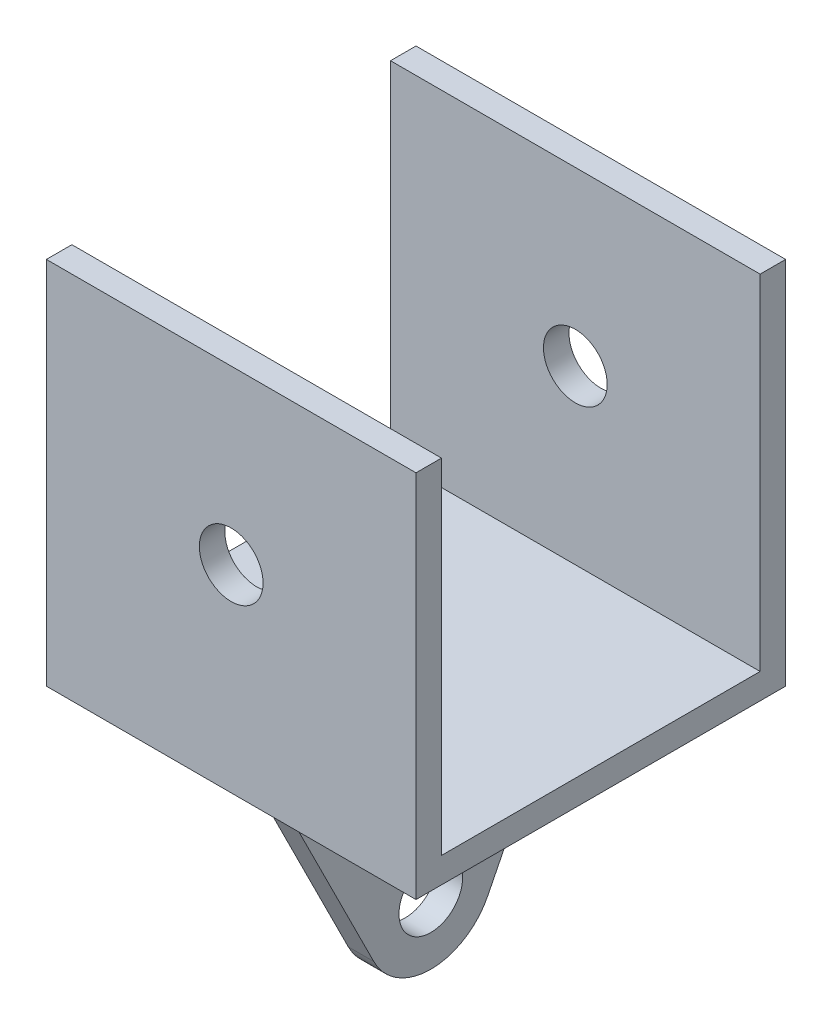
ISO-10303-21;
HEADER;
FILE_DESCRIPTION(('STEP AP214'),'2;1');
FILE_NAME('part.step','',(''),(''),'','','');
FILE_SCHEMA(('AUTOMOTIVE_DESIGN { 1 0 10303 214 1 1 1 1 }'));
ENDSEC;
DATA;
#1=APPLICATION_CONTEXT('core data for automotive mechanical design processes');
#2=APPLICATION_PROTOCOL_DEFINITION('international standard','automotive_design',2000,#1);
#3=PRODUCT_CONTEXT('',#1,'mechanical');
#4=PRODUCT('Part','Part','',(#3));
#5=PRODUCT_RELATED_PRODUCT_CATEGORY('part','',(#4));
#6=PRODUCT_DEFINITION_FORMATION('','',#4);
#7=PRODUCT_DEFINITION_CONTEXT('part definition',#1,'design');
#8=PRODUCT_DEFINITION('design','',#6,#7);
#9=PRODUCT_DEFINITION_SHAPE('','',#8);
#10=(LENGTH_UNIT() NAMED_UNIT(*) SI_UNIT(.MILLI.,.METRE.));
#11=(NAMED_UNIT(*) PLANE_ANGLE_UNIT() SI_UNIT($,.RADIAN.));
#12=(NAMED_UNIT(*) SI_UNIT($,.STERADIAN.) SOLID_ANGLE_UNIT());
#13=UNCERTAINTY_MEASURE_WITH_UNIT(LENGTH_MEASURE(1.E-05),#10,'distance_accuracy_value','');
#14=(GEOMETRIC_REPRESENTATION_CONTEXT(3) GLOBAL_UNCERTAINTY_ASSIGNED_CONTEXT((#13)) GLOBAL_UNIT_ASSIGNED_CONTEXT((#10,
#11,#12)) REPRESENTATION_CONTEXT('',''));
#15=CARTESIAN_POINT('',(0.,0.,0.));
#16=DIRECTION('',(0.,0.,1.));
#17=DIRECTION('',(1.,0.,0.));
#18=AXIS2_PLACEMENT_3D('',#15,#16,#17);
#19=CARTESIAN_POINT('',(-14.5,2.,-14.5));
#20=DIRECTION('',(1.,0.,0.));
#21=DIRECTION('',(0.,0.,-1.));
#22=AXIS2_PLACEMENT_3D('',#19,#20,#21);
#23=PLANE('',#22);
#24=DIRECTION('',(0.,0.,1.));
#25=VECTOR('',#24,1.);
#26=CARTESIAN_POINT('',(-14.5,0.,-14.5));
#27=LINE('',#26,#25);
#28=CARTESIAN_POINT('',(-14.5,0.,-14.5));
#29=VERTEX_POINT('',#28);
#30=CARTESIAN_POINT('',(-14.5,0.,14.5));
#31=VERTEX_POINT('',#30);
#32=EDGE_CURVE('E225',#29,#31,#27,.T.);
#33=ORIENTED_EDGE('',*,*,#32,.T.);
#34=DIRECTION('',(0.,-1.,0.));
#35=VECTOR('',#34,1.);
#36=CARTESIAN_POINT('',(-14.5,2.,14.5));
#37=LINE('',#36,#35);
#38=CARTESIAN_POINT('',(-14.5,29.,14.5));
#39=VERTEX_POINT('',#38);
#40=EDGE_CURVE('E11',#39,#31,#37,.T.);
#41=ORIENTED_EDGE('',*,*,#40,.F.);
#42=DIRECTION('',(0.,0.,1.));
#43=VECTOR('',#42,1.);
#44=CARTESIAN_POINT('',(-14.5,29.,14.5));
#45=LINE('',#44,#43);
#46=CARTESIAN_POINT('',(-14.5,29.,12.5));
#47=VERTEX_POINT('',#46);
#48=EDGE_CURVE('E198',#47,#39,#45,.T.);
#49=ORIENTED_EDGE('',*,*,#48,.F.);
#50=DIRECTION('',(0.,-1.,0.));
#51=VECTOR('',#50,1.);
#52=CARTESIAN_POINT('',(-14.5,29.,12.5));
#53=LINE('',#52,#51);
#54=CARTESIAN_POINT('',(-14.5,2.,12.5));
#55=VERTEX_POINT('',#54);
#56=EDGE_CURVE('E208',#47,#55,#53,.T.);
#57=ORIENTED_EDGE('',*,*,#56,.T.);
#58=DIRECTION('',(0.,0.,1.));
#59=VECTOR('',#58,1.);
#60=CARTESIAN_POINT('',(-14.5,2.,-14.5));
#61=LINE('',#60,#59);
#62=CARTESIAN_POINT('',(-14.5,2.,-12.5));
#63=VERTEX_POINT('',#62);
#64=EDGE_CURVE('E227',#63,#55,#61,.T.);
#65=ORIENTED_EDGE('',*,*,#64,.F.);
#66=DIRECTION('',(0.,-1.,0.));
#67=VECTOR('',#66,1.);
#68=CARTESIAN_POINT('',(-14.5,29.,-12.5));
#69=LINE('',#68,#67);
#70=CARTESIAN_POINT('',(-14.5,29.,-12.5));
#71=VERTEX_POINT('',#70);
#72=EDGE_CURVE('E194',#71,#63,#69,.T.);
#73=ORIENTED_EDGE('',*,*,#72,.F.);
#74=DIRECTION('',(0.,0.,-1.));
#75=VECTOR('',#74,1.);
#76=CARTESIAN_POINT('',(-14.5,29.,-14.5));
#77=LINE('',#76,#75);
#78=CARTESIAN_POINT('',(-14.5,29.,-14.5));
#79=VERTEX_POINT('',#78);
#80=EDGE_CURVE('E178',#71,#79,#77,.T.);
#81=ORIENTED_EDGE('',*,*,#80,.T.);
#82=DIRECTION('',(0.,-1.,0.));
#83=VECTOR('',#82,1.);
#84=CARTESIAN_POINT('',(-14.5,2.,-14.5));
#85=LINE('',#84,#83);
#86=EDGE_CURVE('E231',#79,#29,#85,.T.);
#87=ORIENTED_EDGE('',*,*,#86,.T.);
#88=EDGE_LOOP('',(#33,#41,#49,#57,#65,#73,#81,#87));
#89=FACE_BOUND('',#88,.T.);
#90=ADVANCED_FACE('F35',(#89),#23,.F.);
#91=CARTESIAN_POINT('',(-14.5,2.,14.5));
#92=DIRECTION('',(0.,0.,-1.));
#93=DIRECTION('',(-1.,0.,0.));
#94=AXIS2_PLACEMENT_3D('',#91,#92,#93);
#95=PLANE('',#94);
#96=CARTESIAN_POINT('',(0.,15.5,14.5));
#97=DIRECTION('',(0.,0.,1.));
#98=DIRECTION('',(1.,0.,0.));
#99=AXIS2_PLACEMENT_3D('',#96,#97,#98);
#100=CIRCLE('',#99,2.5);
#101=CARTESIAN_POINT('',(2.50000000000001,15.5,14.5));
#102=VERTEX_POINT('',#101);
#103=EDGE_CURVE('E166',#102,#102,#100,.T.);
#104=ORIENTED_EDGE('',*,*,#103,.F.);
#105=EDGE_LOOP('',(#104));
#106=FACE_BOUND('',#105,.T.);
#107=DIRECTION('',(1.,0.,0.));
#108=VECTOR('',#107,1.);
#109=CARTESIAN_POINT('',(-14.5,0.,14.5));
#110=LINE('',#109,#108);
#111=CARTESIAN_POINT('',(14.5,0.,14.5));
#112=VERTEX_POINT('',#111);
#113=EDGE_CURVE('E238',#31,#112,#110,.T.);
#114=ORIENTED_EDGE('',*,*,#113,.T.);
#115=DIRECTION('',(0.,-1.,0.));
#116=VECTOR('',#115,1.);
#117=CARTESIAN_POINT('',(14.5,2.,14.5));
#118=LINE('',#117,#116);
#119=CARTESIAN_POINT('',(14.5,29.,14.5));
#120=VERTEX_POINT('',#119);
#121=EDGE_CURVE('E43',#120,#112,#118,.T.);
#122=ORIENTED_EDGE('',*,*,#121,.F.);
#123=DIRECTION('',(1.,0.,0.));
#124=VECTOR('',#123,1.);
#125=CARTESIAN_POINT('',(-14.5,29.,14.5));
#126=LINE('',#125,#124);
#127=EDGE_CURVE('E201',#39,#120,#126,.T.);
#128=ORIENTED_EDGE('',*,*,#127,.F.);
#129=ORIENTED_EDGE('',*,*,#40,.T.);
#130=EDGE_LOOP('',(#114,#122,#128,#129));
#131=FACE_BOUND('',#130,.T.);
#132=ADVANCED_FACE('F260',(#106,#131),#95,.F.);
#133=CARTESIAN_POINT('',(14.5,2.,-14.5));
#134=DIRECTION('',(-1.,0.,0.));
#135=DIRECTION('',(0.,0.,1.));
#136=AXIS2_PLACEMENT_3D('',#133,#134,#135);
#137=PLANE('',#136);
#138=DIRECTION('',(0.,0.,-1.));
#139=VECTOR('',#138,1.);
#140=CARTESIAN_POINT('',(14.5,0.,-14.5));
#141=LINE('',#140,#139);
#142=CARTESIAN_POINT('',(14.5,0.,-14.5));
#143=VERTEX_POINT('',#142);
#144=EDGE_CURVE('E232',#112,#143,#141,.T.);
#145=ORIENTED_EDGE('',*,*,#144,.T.);
#146=DIRECTION('',(0.,-1.,0.));
#147=VECTOR('',#146,1.);
#148=CARTESIAN_POINT('',(14.5,2.,-14.5));
#149=LINE('',#148,#147);
#150=CARTESIAN_POINT('',(14.5,29.,-14.5));
#151=VERTEX_POINT('',#150);
#152=EDGE_CURVE('E243',#151,#143,#149,.T.);
#153=ORIENTED_EDGE('',*,*,#152,.F.);
#154=DIRECTION('',(0.,0.,1.));
#155=VECTOR('',#154,1.);
#156=CARTESIAN_POINT('',(14.5,29.,-14.5));
#157=LINE('',#156,#155);
#158=CARTESIAN_POINT('',(14.5,29.,-12.5));
#159=VERTEX_POINT('',#158);
#160=EDGE_CURVE('E184',#151,#159,#157,.T.);
#161=ORIENTED_EDGE('',*,*,#160,.T.);
#162=DIRECTION('',(0.,-1.,0.));
#163=VECTOR('',#162,1.);
#164=CARTESIAN_POINT('',(14.5,29.,-12.5));
#165=LINE('',#164,#163);
#166=CARTESIAN_POINT('',(14.5,2.,-12.5));
#167=VERTEX_POINT('',#166);
#168=EDGE_CURVE('E190',#159,#167,#165,.T.);
#169=ORIENTED_EDGE('',*,*,#168,.T.);
#170=DIRECTION('',(0.,0.,-1.));
#171=VECTOR('',#170,1.);
#172=CARTESIAN_POINT('',(14.5,2.,-14.5));
#173=LINE('',#172,#171);
#174=CARTESIAN_POINT('',(14.5,2.,12.5));
#175=VERTEX_POINT('',#174);
#176=EDGE_CURVE('E217',#175,#167,#173,.T.);
#177=ORIENTED_EDGE('',*,*,#176,.F.);
#178=DIRECTION('',(0.,-1.,0.));
#179=VECTOR('',#178,1.);
#180=CARTESIAN_POINT('',(14.5,29.,12.5));
#181=LINE('',#180,#179);
#182=CARTESIAN_POINT('',(14.5,29.,12.5));
#183=VERTEX_POINT('',#182);
#184=EDGE_CURVE('E220',#183,#175,#181,.T.);
#185=ORIENTED_EDGE('',*,*,#184,.F.);
#186=DIRECTION('',(0.,0.,-1.));
#187=VECTOR('',#186,1.);
#188=CARTESIAN_POINT('',(14.5,29.,14.5));
#189=LINE('',#188,#187);
#190=EDGE_CURVE('E204',#120,#183,#189,.T.);
#191=ORIENTED_EDGE('',*,*,#190,.F.);
#192=ORIENTED_EDGE('',*,*,#121,.T.);
#193=EDGE_LOOP('',(#145,#153,#161,#169,#177,#185,#191,#192));
#194=FACE_BOUND('',#193,.T.);
#195=ADVANCED_FACE('F249',(#194),#137,.F.);
#196=CARTESIAN_POINT('',(-14.5,2.,-14.5));
#197=DIRECTION('',(0.,0.,1.));
#198=DIRECTION('',(1.,0.,0.));
#199=AXIS2_PLACEMENT_3D('',#196,#197,#198);
#200=PLANE('',#199);
#201=CARTESIAN_POINT('',(0.,15.5,-14.5));
#202=DIRECTION('',(0.,0.,1.));
#203=DIRECTION('',(1.,0.,0.));
#204=AXIS2_PLACEMENT_3D('',#201,#202,#203);
#205=CIRCLE('',#204,2.5);
#206=CARTESIAN_POINT('',(2.50000000000001,15.5,-14.5));
#207=VERTEX_POINT('',#206);
#208=EDGE_CURVE('E169',#207,#207,#205,.T.);
#209=ORIENTED_EDGE('',*,*,#208,.T.);
#210=EDGE_LOOP('',(#209));
#211=FACE_BOUND('',#210,.T.);
#212=DIRECTION('',(-1.,0.,0.));
#213=VECTOR('',#212,1.);
#214=CARTESIAN_POINT('',(-14.5,0.,-14.5));
#215=LINE('',#214,#213);
#216=EDGE_CURVE('E228',#143,#29,#215,.T.);
#217=ORIENTED_EDGE('',*,*,#216,.T.);
#218=ORIENTED_EDGE('',*,*,#86,.F.);
#219=DIRECTION('',(1.,0.,0.));
#220=VECTOR('',#219,1.);
#221=CARTESIAN_POINT('',(-14.5,29.,-14.5));
#222=LINE('',#221,#220);
#223=EDGE_CURVE('E187',#79,#151,#222,.T.);
#224=ORIENTED_EDGE('',*,*,#223,.T.);
#225=ORIENTED_EDGE('',*,*,#152,.T.);
#226=EDGE_LOOP('',(#217,#218,#224,#225));
#227=FACE_BOUND('',#226,.T.);
#228=ADVANCED_FACE('F279',(#211,#227),#200,.F.);
#229=CARTESIAN_POINT('',(0.,2.,0.));
#230=DIRECTION('',(0.,1.,0.));
#231=DIRECTION('',(0.,0.,1.));
#232=AXIS2_PLACEMENT_3D('',#229,#230,#231);
#233=PLANE('',#232);
#234=DIRECTION('',(-1.,0.,0.));
#235=VECTOR('',#234,1.);
#236=CARTESIAN_POINT('',(-14.5,2.,-12.5));
#237=LINE('',#236,#235);
#238=EDGE_CURVE('E177',#167,#63,#237,.T.);
#239=ORIENTED_EDGE('',*,*,#238,.T.);
#240=ORIENTED_EDGE('',*,*,#64,.T.);
#241=DIRECTION('',(-1.,0.,0.));
#242=VECTOR('',#241,1.);
#243=CARTESIAN_POINT('',(-14.5,2.,12.5));
#244=LINE('',#243,#242);
#245=EDGE_CURVE('E197',#175,#55,#244,.T.);
#246=ORIENTED_EDGE('',*,*,#245,.F.);
#247=ORIENTED_EDGE('',*,*,#176,.T.);
#248=EDGE_LOOP('',(#239,#240,#246,#247));
#249=FACE_BOUND('',#248,.T.);
#250=ADVANCED_FACE('F269',(#249),#233,.T.);
#251=CARTESIAN_POINT('',(0.,0.,0.));
#252=DIRECTION('',(0.,1.,0.));
#253=DIRECTION('',(0.,0.,1.));
#254=AXIS2_PLACEMENT_3D('',#251,#252,#253);
#255=PLANE('',#254);
#256=DIRECTION('',(1.,0.,0.));
#257=VECTOR('',#256,1.);
#258=CARTESIAN_POINT('',(-1.,0.,-12.662436349393));
#259=LINE('',#258,#257);
#260=CARTESIAN_POINT('',(-1.,0.,-12.662436349393));
#261=VERTEX_POINT('',#260);
#262=CARTESIAN_POINT('',(1.,0.,-12.662436349393));
#263=VERTEX_POINT('',#262);
#264=EDGE_CURVE('E56',#261,#263,#259,.T.);
#265=ORIENTED_EDGE('',*,*,#264,.F.);
#266=DIRECTION('',(0.,0.,1.));
#267=VECTOR('',#266,1.);
#268=CARTESIAN_POINT('',(-1.,0.,12.3405349213244));
#269=LINE('',#268,#267);
#270=CARTESIAN_POINT('',(-1.,0.,12.3405349213244));
#271=VERTEX_POINT('',#270);
#272=EDGE_CURVE('E51',#261,#271,#269,.T.);
#273=ORIENTED_EDGE('',*,*,#272,.T.);
#274=DIRECTION('',(1.,0.,0.));
#275=VECTOR('',#274,1.);
#276=CARTESIAN_POINT('',(-1.,0.,12.3405349213244));
#277=LINE('',#276,#275);
#278=CARTESIAN_POINT('',(1.,0.,12.3405349213244));
#279=VERTEX_POINT('',#278);
#280=EDGE_CURVE('E164',#271,#279,#277,.T.);
#281=ORIENTED_EDGE('',*,*,#280,.T.);
#282=DIRECTION('',(0.,0.,1.));
#283=VECTOR('',#282,1.);
#284=CARTESIAN_POINT('',(1.,0.,12.3405349213244));
#285=LINE('',#284,#283);
#286=EDGE_CURVE('E147',#263,#279,#285,.T.);
#287=ORIENTED_EDGE('',*,*,#286,.F.);
#288=EDGE_LOOP('',(#265,#273,#281,#287));
#289=FACE_BOUND('',#288,.T.);
#290=ORIENTED_EDGE('',*,*,#32,.F.);
#291=ORIENTED_EDGE('',*,*,#216,.F.);
#292=ORIENTED_EDGE('',*,*,#144,.F.);
#293=ORIENTED_EDGE('',*,*,#113,.F.);
#294=EDGE_LOOP('',(#290,#291,#292,#293));
#295=FACE_BOUND('',#294,.T.);
#296=ADVANCED_FACE('F255',(#289,#295),#255,.F.);
#297=CARTESIAN_POINT('',(-14.5,29.,12.5));
#298=DIRECTION('',(0.,0.,1.));
#299=DIRECTION('',(1.,0.,0.));
#300=AXIS2_PLACEMENT_3D('',#297,#298,#299);
#301=PLANE('',#300);
#302=CARTESIAN_POINT('',(0.,15.5,12.5));
#303=DIRECTION('',(0.,0.,1.));
#304=DIRECTION('',(1.,0.,0.));
#305=AXIS2_PLACEMENT_3D('',#302,#303,#304);
#306=CIRCLE('',#305,2.5);
#307=CARTESIAN_POINT('',(2.50000000000001,15.5,12.5));
#308=VERTEX_POINT('',#307);
#309=EDGE_CURVE('E174',#308,#308,#306,.T.);
#310=ORIENTED_EDGE('',*,*,#309,.T.);
#311=EDGE_LOOP('',(#310));
#312=FACE_BOUND('',#311,.T.);
#313=ORIENTED_EDGE('',*,*,#245,.T.);
#314=ORIENTED_EDGE('',*,*,#56,.F.);
#315=DIRECTION('',(-1.,0.,0.));
#316=VECTOR('',#315,1.);
#317=CARTESIAN_POINT('',(-14.5,29.,12.5));
#318=LINE('',#317,#316);
#319=EDGE_CURVE('E206',#183,#47,#318,.T.);
#320=ORIENTED_EDGE('',*,*,#319,.F.);
#321=ORIENTED_EDGE('',*,*,#184,.T.);
#322=EDGE_LOOP('',(#313,#314,#320,#321));
#323=FACE_BOUND('',#322,.T.);
#324=ADVANCED_FACE('F267',(#312,#323),#301,.F.);
#325=CARTESIAN_POINT('',(0.,29.,0.));
#326=DIRECTION('',(0.,-1.,0.));
#327=DIRECTION('',(0.,0.,-1.));
#328=AXIS2_PLACEMENT_3D('',#325,#326,#327);
#329=PLANE('',#328);
#330=ORIENTED_EDGE('',*,*,#48,.T.);
#331=ORIENTED_EDGE('',*,*,#127,.T.);
#332=ORIENTED_EDGE('',*,*,#190,.T.);
#333=ORIENTED_EDGE('',*,*,#319,.T.);
#334=EDGE_LOOP('',(#330,#331,#332,#333));
#335=FACE_BOUND('',#334,.T.);
#336=ADVANCED_FACE('F264',(#335),#329,.F.);
#337=CARTESIAN_POINT('',(-14.5,29.,-12.5));
#338=DIRECTION('',(0.,0.,1.));
#339=DIRECTION('',(1.,0.,0.));
#340=AXIS2_PLACEMENT_3D('',#337,#338,#339);
#341=PLANE('',#340);
#342=CARTESIAN_POINT('',(0.,15.5,-12.5));
#343=DIRECTION('',(0.,0.,1.));
#344=DIRECTION('',(1.,0.,0.));
#345=AXIS2_PLACEMENT_3D('',#342,#343,#344);
#346=CIRCLE('',#345,2.5);
#347=CARTESIAN_POINT('',(2.50000000000001,15.5,-12.5));
#348=VERTEX_POINT('',#347);
#349=EDGE_CURVE('E38',#348,#348,#346,.T.);
#350=ORIENTED_EDGE('',*,*,#349,.F.);
#351=EDGE_LOOP('',(#350));
#352=FACE_BOUND('',#351,.T.);
#353=ORIENTED_EDGE('',*,*,#238,.F.);
#354=ORIENTED_EDGE('',*,*,#168,.F.);
#355=DIRECTION('',(-1.,0.,0.));
#356=VECTOR('',#355,1.);
#357=CARTESIAN_POINT('',(-14.5,29.,-12.5));
#358=LINE('',#357,#356);
#359=EDGE_CURVE('E181',#159,#71,#358,.T.);
#360=ORIENTED_EDGE('',*,*,#359,.T.);
#361=ORIENTED_EDGE('',*,*,#72,.T.);
#362=EDGE_LOOP('',(#353,#354,#360,#361));
#363=FACE_BOUND('',#362,.T.);
#364=ADVANCED_FACE('F274',(#352,#363),#341,.T.);
#365=CARTESIAN_POINT('',(0.,29.,0.));
#366=DIRECTION('',(0.,-1.,0.));
#367=DIRECTION('',(0.,0.,1.));
#368=AXIS2_PLACEMENT_3D('',#365,#366,#367);
#369=PLANE('',#368);
#370=ORIENTED_EDGE('',*,*,#80,.F.);
#371=ORIENTED_EDGE('',*,*,#359,.F.);
#372=ORIENTED_EDGE('',*,*,#160,.F.);
#373=ORIENTED_EDGE('',*,*,#223,.F.);
#374=EDGE_LOOP('',(#370,#371,#372,#373));
#375=FACE_BOUND('',#374,.T.);
#376=ADVANCED_FACE('F278',(#375),#369,.F.);
#377=CARTESIAN_POINT('',(0.,15.5,-14.5));
#378=DIRECTION('',(0.,0.,1.));
#379=DIRECTION('',(1.,0.,0.));
#380=AXIS2_PLACEMENT_3D('',#377,#378,#379);
#381=CYLINDRICAL_SURFACE('',#380,2.5);
#382=ORIENTED_EDGE('',*,*,#349,.T.);
#383=EDGE_LOOP('',(#382));
#384=FACE_BOUND('',#383,.T.);
#385=ORIENTED_EDGE('',*,*,#208,.F.);
#386=EDGE_LOOP('',(#385));
#387=FACE_BOUND('',#386,.T.);
#388=ADVANCED_FACE('F302',(#384,#387),#381,.F.);
#389=ORIENTED_EDGE('',*,*,#103,.T.);
#390=EDGE_LOOP('',(#389));
#391=FACE_BOUND('',#390,.T.);
#392=ORIENTED_EDGE('',*,*,#309,.F.);
#393=EDGE_LOOP('',(#392));
#394=FACE_BOUND('',#393,.T.);
#395=ADVANCED_FACE('F299',(#391,#394),#381,.F.);
#396=CARTESIAN_POINT('',(-1.,-16.0570035844146,4.31107893502589));
#397=DIRECTION('',(0.,-0.447256115348991,0.894405929812034));
#398=DIRECTION('',(0.,-0.894405929812034,-0.447256115348991));
#399=AXIS2_PLACEMENT_3D('',#396,#397,#398);
#400=PLANE('',#399);
#401=DIRECTION('',(1.,0.,0.));
#402=VECTOR('',#401,1.);
#403=CARTESIAN_POINT('',(-1.,-16.0570035844146,4.31107893502589));
#404=LINE('',#403,#402);
#405=CARTESIAN_POINT('',(-1.,-16.0570035844146,4.31107893502589));
#406=VERTEX_POINT('',#405);
#407=CARTESIAN_POINT('',(1.,-16.0570035844146,4.31107893502589));
#408=VERTEX_POINT('',#407);
#409=EDGE_CURVE('E124',#406,#408,#404,.T.);
#410=ORIENTED_EDGE('',*,*,#409,.T.);
#411=DIRECTION('',(0.,-0.894405929812034,-0.447256115348991));
#412=VECTOR('',#411,1.);
#413=CARTESIAN_POINT('',(1.,-16.0570035844146,4.31107893502589));
#414=LINE('',#413,#412);
#415=EDGE_CURVE('E128',#279,#408,#414,.T.);
#416=ORIENTED_EDGE('',*,*,#415,.F.);
#417=ORIENTED_EDGE('',*,*,#280,.F.);
#418=DIRECTION('',(0.,-0.894405929812034,-0.447256115348991));
#419=VECTOR('',#418,1.);
#420=CARTESIAN_POINT('',(-1.,-16.0570035844146,4.31107893502589));
#421=LINE('',#420,#419);
#422=EDGE_CURVE('E130',#271,#406,#421,.T.);
#423=ORIENTED_EDGE('',*,*,#422,.T.);
#424=EDGE_LOOP('',(#410,#416,#417,#423));
#425=FACE_BOUND('',#424,.T.);
#426=ADVANCED_FACE('F126',(#425),#400,.T.);
#427=CARTESIAN_POINT('',(-1.,0.,-12.662436349393));
#428=DIRECTION('',(0.,-0.447256115348991,-0.894405929812034));
#429=DIRECTION('',(0.,0.894405929812034,-0.447256115348991));
#430=AXIS2_PLACEMENT_3D('',#427,#428,#429);
#431=PLANE('',#430);
#432=ORIENTED_EDGE('',*,*,#264,.T.);
#433=DIRECTION('',(0.,0.894405929812034,-0.447256115348991));
#434=VECTOR('',#433,1.);
#435=CARTESIAN_POINT('',(1.,0.,-12.662436349393));
#436=LINE('',#435,#434);
#437=CARTESIAN_POINT('',(1.,-16.0570035844146,-4.63298036309453));
#438=VERTEX_POINT('',#437);
#439=EDGE_CURVE('E142',#438,#263,#436,.T.);
#440=ORIENTED_EDGE('',*,*,#439,.F.);
#441=DIRECTION('',(1.,0.,0.));
#442=VECTOR('',#441,1.);
#443=CARTESIAN_POINT('',(-1.,-16.0570035844146,-4.63298036309453));
#444=LINE('',#443,#442);
#445=CARTESIAN_POINT('',(-1.,-16.0570035844146,-4.63298036309453));
#446=VERTEX_POINT('',#445);
#447=EDGE_CURVE('E134',#446,#438,#444,.T.);
#448=ORIENTED_EDGE('',*,*,#447,.F.);
#449=DIRECTION('',(0.,0.894405929812034,-0.447256115348991));
#450=VECTOR('',#449,1.);
#451=CARTESIAN_POINT('',(-1.,0.,-12.662436349393));
#452=LINE('',#451,#450);
#453=EDGE_CURVE('E161',#446,#261,#452,.T.);
#454=ORIENTED_EDGE('',*,*,#453,.T.);
#455=EDGE_LOOP('',(#432,#440,#448,#454));
#456=FACE_BOUND('',#455,.T.);
#457=ADVANCED_FACE('F323',(#456),#431,.T.);
#458=CARTESIAN_POINT('',(-1.,-13.8207230076697,-0.160950714034321));
#459=DIRECTION('',(1.,0.,0.));
#460=DIRECTION('',(0.,0.,-1.));
#461=AXIS2_PLACEMENT_3D('',#458,#459,#460);
#462=CYLINDRICAL_SURFACE('',#461,5.);
#463=ORIENTED_EDGE('',*,*,#447,.T.);
#464=CARTESIAN_POINT('',(1.,-13.8207230076697,-0.160950714034321));
#465=DIRECTION('',(1.,0.,0.));
#466=DIRECTION('',(0.,0.,1.));
#467=AXIS2_PLACEMENT_3D('',#464,#465,#466);
#468=CIRCLE('',#467,5.);
#469=EDGE_CURVE('E137',#408,#438,#468,.T.);
#470=ORIENTED_EDGE('',*,*,#469,.F.);
#471=ORIENTED_EDGE('',*,*,#409,.F.);
#472=CARTESIAN_POINT('',(-1.,-13.8207230076697,-0.160950714034321));
#473=DIRECTION('',(1.,0.,0.));
#474=DIRECTION('',(0.,0.,1.));
#475=AXIS2_PLACEMENT_3D('',#472,#473,#474);
#476=CIRCLE('',#475,5.);
#477=EDGE_CURVE('E159',#406,#446,#476,.T.);
#478=ORIENTED_EDGE('',*,*,#477,.T.);
#479=EDGE_LOOP('',(#463,#470,#471,#478));
#480=FACE_BOUND('',#479,.T.);
#481=ADVANCED_FACE('F138',(#480),#462,.T.);
#482=CARTESIAN_POINT('',(-1.,-13.8207230076697,-0.160950714034321));
#483=DIRECTION('',(-1.,0.,0.));
#484=DIRECTION('',(0.,0.,1.));
#485=AXIS2_PLACEMENT_3D('',#482,#483,#484);
#486=PLANE('',#485);
#487=CARTESIAN_POINT('',(-1.,-13.8207230076697,-0.160950714034321));
#488=DIRECTION('',(1.,0.,0.));
#489=DIRECTION('',(0.,0.,-1.));
#490=AXIS2_PLACEMENT_3D('',#487,#488,#489);
#491=CIRCLE('',#490,2.5);
#492=CARTESIAN_POINT('',(-1.,-13.8207230076697,-2.66095071403432));
#493=VERTEX_POINT('',#492);
#494=EDGE_CURVE('E155',#493,#493,#491,.T.);
#495=ORIENTED_EDGE('',*,*,#494,.T.);
#496=EDGE_LOOP('',(#495));
#497=FACE_BOUND('',#496,.T.);
#498=ORIENTED_EDGE('',*,*,#422,.F.);
#499=ORIENTED_EDGE('',*,*,#272,.F.);
#500=ORIENTED_EDGE('',*,*,#453,.F.);
#501=ORIENTED_EDGE('',*,*,#477,.F.);
#502=EDGE_LOOP('',(#498,#499,#500,#501));
#503=FACE_BOUND('',#502,.T.);
#504=ADVANCED_FACE('F326',(#497,#503),#486,.T.);
#505=CARTESIAN_POINT('',(-1.,-13.8207230076697,-0.160950714034321));
#506=DIRECTION('',(1.,0.,0.));
#507=DIRECTION('',(0.,0.,-1.));
#508=AXIS2_PLACEMENT_3D('',#505,#506,#507);
#509=CYLINDRICAL_SURFACE('',#508,2.5);
#510=ORIENTED_EDGE('',*,*,#494,.F.);
#511=EDGE_LOOP('',(#510));
#512=FACE_BOUND('',#511,.T.);
#513=CARTESIAN_POINT('',(1.,-13.8207230076697,-0.160950714034321));
#514=DIRECTION('',(1.,0.,0.));
#515=DIRECTION('',(0.,0.,-1.));
#516=AXIS2_PLACEMENT_3D('',#513,#514,#515);
#517=CIRCLE('',#516,2.5);
#518=CARTESIAN_POINT('',(1.,-13.8207230076697,-2.66095071403432));
#519=VERTEX_POINT('',#518);
#520=EDGE_CURVE('E148',#519,#519,#517,.T.);
#521=ORIENTED_EDGE('',*,*,#520,.T.);
#522=EDGE_LOOP('',(#521));
#523=FACE_BOUND('',#522,.T.);
#524=ADVANCED_FACE('F332',(#512,#523),#509,.F.);
#525=CARTESIAN_POINT('',(1.,-13.8207230076697,-0.160950714034321));
#526=DIRECTION('',(-1.,0.,0.));
#527=DIRECTION('',(0.,0.,1.));
#528=AXIS2_PLACEMENT_3D('',#525,#526,#527);
#529=PLANE('',#528);
#530=ORIENTED_EDGE('',*,*,#415,.T.);
#531=ORIENTED_EDGE('',*,*,#469,.T.);
#532=ORIENTED_EDGE('',*,*,#439,.T.);
#533=ORIENTED_EDGE('',*,*,#286,.T.);
#534=EDGE_LOOP('',(#530,#531,#532,#533));
#535=FACE_BOUND('',#534,.T.);
#536=ORIENTED_EDGE('',*,*,#520,.F.);
#537=EDGE_LOOP('',(#536));
#538=FACE_BOUND('',#537,.T.);
#539=ADVANCED_FACE('F145',(#535,#538),#529,.F.);
#540=CLOSED_SHELL('',(#90,#132,#195,#228,#250,#296,#324,#336,#364,#376,#388,#395,#426,#457,#481,
#504,#524,#539));
#541=MANIFOLD_SOLID_BREP('B2',#540);
#542=ADVANCED_BREP_SHAPE_REPRESENTATION('',(#18,#541),#14);
#543=SHAPE_DEFINITION_REPRESENTATION(#9,#542);
ENDSEC;
END-ISO-10303-21;
